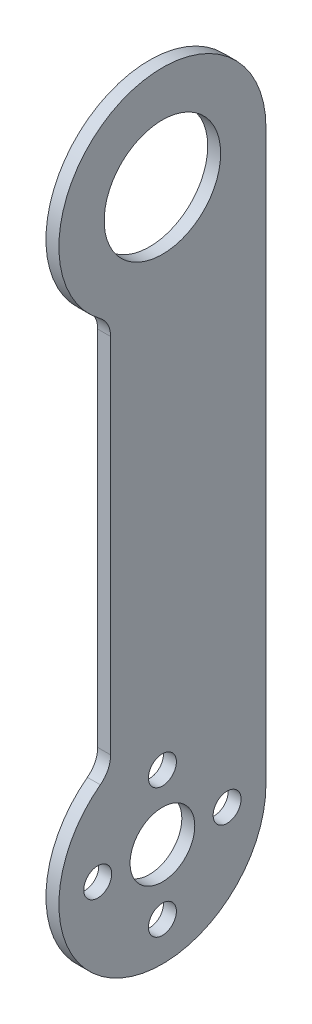
ISO-10303-21;
HEADER;
FILE_DESCRIPTION(('STEP AP214'),'2;1');
FILE_NAME('part.step','',(''),(''),'','','');
FILE_SCHEMA(('AUTOMOTIVE_DESIGN { 1 0 10303 214 1 1 1 1 }'));
ENDSEC;
DATA;
#1=APPLICATION_CONTEXT('core data for automotive mechanical design processes');
#2=APPLICATION_PROTOCOL_DEFINITION('international standard','automotive_design',2000,#1);
#3=PRODUCT_CONTEXT('',#1,'mechanical');
#4=PRODUCT('Part','Part','',(#3));
#5=PRODUCT_RELATED_PRODUCT_CATEGORY('part','',(#4));
#6=PRODUCT_DEFINITION_FORMATION('','',#4);
#7=PRODUCT_DEFINITION_CONTEXT('part definition',#1,'design');
#8=PRODUCT_DEFINITION('design','',#6,#7);
#9=PRODUCT_DEFINITION_SHAPE('','',#8);
#10=(LENGTH_UNIT() NAMED_UNIT(*) SI_UNIT(.MILLI.,.METRE.));
#11=(NAMED_UNIT(*) PLANE_ANGLE_UNIT() SI_UNIT($,.RADIAN.));
#12=(NAMED_UNIT(*) SI_UNIT($,.STERADIAN.) SOLID_ANGLE_UNIT());
#13=UNCERTAINTY_MEASURE_WITH_UNIT(LENGTH_MEASURE(1.E-05),#10,'distance_accuracy_value','');
#14=(GEOMETRIC_REPRESENTATION_CONTEXT(3) GLOBAL_UNCERTAINTY_ASSIGNED_CONTEXT((#13)) GLOBAL_UNIT_ASSIGNED_CONTEXT((#10,
#11,#12)) REPRESENTATION_CONTEXT('',''));
#15=CARTESIAN_POINT('',(0.,0.,0.));
#16=DIRECTION('',(0.,0.,1.));
#17=DIRECTION('',(1.,0.,0.));
#18=AXIS2_PLACEMENT_3D('',#15,#16,#17);
#19=CARTESIAN_POINT('',(3.175,139.7,0.));
#20=DIRECTION('',(1.,0.,0.));
#21=DIRECTION('',(0.,0.,-1.));
#22=AXIS2_PLACEMENT_3D('',#19,#20,#21);
#23=PLANE('',#22);
#24=CARTESIAN_POINT('',(3.175,-15.875,1.10854532508269E-13));
#25=DIRECTION('',(1.,0.,0.));
#26=DIRECTION('',(0.,0.,-1.));
#27=AXIS2_PLACEMENT_3D('',#24,#25,#26);
#28=CIRCLE('',#27,3.429);
#29=CARTESIAN_POINT('',(3.175,-15.875,-3.42899999999989));
#30=VERTEX_POINT('',#29);
#31=EDGE_CURVE('E224',#30,#30,#28,.T.);
#32=ORIENTED_EDGE('',*,*,#31,.F.);
#33=EDGE_LOOP('',(#32));
#34=FACE_BOUND('',#33,.T.);
#35=CARTESIAN_POINT('',(3.175,15.875,0.));
#36=DIRECTION('',(1.,0.,0.));
#37=DIRECTION('',(0.,0.,-1.));
#38=AXIS2_PLACEMENT_3D('',#35,#36,#37);
#39=CIRCLE('',#38,3.429);
#40=CARTESIAN_POINT('',(3.175,15.875,-3.429));
#41=VERTEX_POINT('',#40);
#42=EDGE_CURVE('E240',#41,#41,#39,.T.);
#43=ORIENTED_EDGE('',*,*,#42,.F.);
#44=EDGE_LOOP('',(#43));
#45=FACE_BOUND('',#44,.T.);
#46=CARTESIAN_POINT('',(3.175,0.,0.));
#47=DIRECTION('',(1.,0.,0.));
#48=DIRECTION('',(0.,0.,-1.));
#49=AXIS2_PLACEMENT_3D('',#46,#47,#48);
#50=CIRCLE('',#49,7.9375);
#51=CARTESIAN_POINT('',(3.175,0.,-7.9375));
#52=VERTEX_POINT('',#51);
#53=EDGE_CURVE('E138',#52,#52,#50,.T.);
#54=ORIENTED_EDGE('',*,*,#53,.F.);
#55=EDGE_LOOP('',(#54));
#56=FACE_BOUND('',#55,.T.);
#57=CARTESIAN_POINT('',(3.175,139.7,0.));
#58=DIRECTION('',(1.,0.,0.));
#59=DIRECTION('',(0.,0.,-1.));
#60=AXIS2_PLACEMENT_3D('',#57,#58,#59);
#61=CIRCLE('',#60,25.4);
#62=CARTESIAN_POINT('',(3.175,139.7,-25.4));
#63=VERTEX_POINT('',#62);
#64=CARTESIAN_POINT('',(3.175,119.38,15.24));
#65=VERTEX_POINT('',#64);
#66=EDGE_CURVE('E150',#63,#65,#61,.T.);
#67=ORIENTED_EDGE('',*,*,#66,.T.);
#68=CARTESIAN_POINT('',(3.175,114.3,19.05));
#69=DIRECTION('',(-1.,0.,0.));
#70=DIRECTION('',(0.,0.,-1.));
#71=AXIS2_PLACEMENT_3D('',#68,#69,#70);
#72=CIRCLE('',#71,6.35);
#73=CARTESIAN_POINT('',(3.175,114.3,12.7));
#74=VERTEX_POINT('',#73);
#75=EDGE_CURVE('E98',#65,#74,#72,.T.);
#76=ORIENTED_EDGE('',*,*,#75,.T.);
#77=DIRECTION('',(0.,-1.,0.));
#78=VECTOR('',#77,1.);
#79=CARTESIAN_POINT('',(3.175,114.3,12.7));
#80=LINE('',#79,#78);
#81=CARTESIAN_POINT('',(3.175,25.4,12.7));
#82=VERTEX_POINT('',#81);
#83=EDGE_CURVE('E111',#74,#82,#80,.T.);
#84=ORIENTED_EDGE('',*,*,#83,.T.);
#85=CARTESIAN_POINT('',(3.175,25.4,19.05));
#86=DIRECTION('',(-1.,0.,0.));
#87=DIRECTION('',(0.,0.,1.));
#88=AXIS2_PLACEMENT_3D('',#85,#86,#87);
#89=CIRCLE('',#88,6.35);
#90=CARTESIAN_POINT('',(3.175,20.32,15.24));
#91=VERTEX_POINT('',#90);
#92=EDGE_CURVE('E105',#82,#91,#89,.T.);
#93=ORIENTED_EDGE('',*,*,#92,.T.);
#94=CARTESIAN_POINT('',(3.175,0.,0.));
#95=DIRECTION('',(1.,0.,0.));
#96=DIRECTION('',(0.,0.,-1.));
#97=AXIS2_PLACEMENT_3D('',#94,#95,#96);
#98=CIRCLE('',#97,25.4);
#99=CARTESIAN_POINT('',(3.175,0.,-25.4));
#100=VERTEX_POINT('',#99);
#101=EDGE_CURVE('E109',#91,#100,#98,.T.);
#102=ORIENTED_EDGE('',*,*,#101,.T.);
#103=DIRECTION('',(0.,1.,0.));
#104=VECTOR('',#103,1.);
#105=CARTESIAN_POINT('',(3.175,139.7,-25.4));
#106=LINE('',#105,#104);
#107=EDGE_CURVE('E61',#100,#63,#106,.T.);
#108=ORIENTED_EDGE('',*,*,#107,.T.);
#109=EDGE_LOOP('',(#67,#76,#84,#93,#102,#108));
#110=FACE_BOUND('',#109,.T.);
#111=CARTESIAN_POINT('',(3.175,139.7,0.));
#112=DIRECTION('',(1.,0.,0.));
#113=DIRECTION('',(0.,0.,-1.));
#114=AXIS2_PLACEMENT_3D('',#111,#112,#113);
#115=CIRCLE('',#114,14.2875);
#116=CARTESIAN_POINT('',(3.175,139.7,-14.2875));
#117=VERTEX_POINT('',#116);
#118=EDGE_CURVE('E248',#117,#117,#115,.T.);
#119=ORIENTED_EDGE('',*,*,#118,.F.);
#120=EDGE_LOOP('',(#119));
#121=FACE_BOUND('',#120,.T.);
#122=CARTESIAN_POINT('',(3.175,0.,-15.875));
#123=DIRECTION('',(1.,0.,0.));
#124=DIRECTION('',(0.,0.,-1.));
#125=AXIS2_PLACEMENT_3D('',#122,#123,#124);
#126=CIRCLE('',#125,3.429);
#127=CARTESIAN_POINT('',(3.175,0.,-19.304));
#128=VERTEX_POINT('',#127);
#129=EDGE_CURVE('E232',#128,#128,#126,.T.);
#130=ORIENTED_EDGE('',*,*,#129,.F.);
#131=EDGE_LOOP('',(#130));
#132=FACE_BOUND('',#131,.T.);
#133=CARTESIAN_POINT('',(3.175,0.,15.875));
#134=DIRECTION('',(1.,0.,0.));
#135=DIRECTION('',(0.,0.,-1.));
#136=AXIS2_PLACEMENT_3D('',#133,#134,#135);
#137=CIRCLE('',#136,3.42900000000016);
#138=CARTESIAN_POINT('',(3.175,0.,12.4459999999998));
#139=VERTEX_POINT('',#138);
#140=EDGE_CURVE('E213',#139,#139,#137,.T.);
#141=ORIENTED_EDGE('',*,*,#140,.F.);
#142=EDGE_LOOP('',(#141));
#143=FACE_BOUND('',#142,.T.);
#144=ADVANCED_FACE('F43',(#34,#45,#56,#110,#121,#132,#143),#23,.T.);
#145=CARTESIAN_POINT('',(0.,139.7,0.));
#146=DIRECTION('',(1.,0.,0.));
#147=DIRECTION('',(0.,0.,-1.));
#148=AXIS2_PLACEMENT_3D('',#145,#146,#147);
#149=PLANE('',#148);
#150=CARTESIAN_POINT('',(0.,139.7,0.));
#151=DIRECTION('',(1.,0.,0.));
#152=DIRECTION('',(0.,0.,-1.));
#153=AXIS2_PLACEMENT_3D('',#150,#151,#152);
#154=CIRCLE('',#153,25.4);
#155=CARTESIAN_POINT('',(0.,139.7,-25.4));
#156=VERTEX_POINT('',#155);
#157=CARTESIAN_POINT('',(0.,119.38,15.24));
#158=VERTEX_POINT('',#157);
#159=EDGE_CURVE('E133',#156,#158,#154,.T.);
#160=ORIENTED_EDGE('',*,*,#159,.F.);
#161=DIRECTION('',(0.,1.,0.));
#162=VECTOR('',#161,1.);
#163=CARTESIAN_POINT('',(0.,139.7,-25.4));
#164=LINE('',#163,#162);
#165=CARTESIAN_POINT('',(0.,0.,-25.4));
#166=VERTEX_POINT('',#165);
#167=EDGE_CURVE('E90',#166,#156,#164,.T.);
#168=ORIENTED_EDGE('',*,*,#167,.F.);
#169=CARTESIAN_POINT('',(0.,0.,0.));
#170=DIRECTION('',(1.,0.,0.));
#171=DIRECTION('',(0.,0.,-1.));
#172=AXIS2_PLACEMENT_3D('',#169,#170,#171);
#173=CIRCLE('',#172,25.4);
#174=CARTESIAN_POINT('',(0.,20.32,15.24));
#175=VERTEX_POINT('',#174);
#176=EDGE_CURVE('E84',#175,#166,#173,.T.);
#177=ORIENTED_EDGE('',*,*,#176,.F.);
#178=CARTESIAN_POINT('',(0.,25.4,19.05));
#179=DIRECTION('',(-1.,0.,0.));
#180=DIRECTION('',(0.,0.,1.));
#181=AXIS2_PLACEMENT_3D('',#178,#179,#180);
#182=CIRCLE('',#181,6.35);
#183=CARTESIAN_POINT('',(0.,25.4,12.7));
#184=VERTEX_POINT('',#183);
#185=EDGE_CURVE('E120',#184,#175,#182,.T.);
#186=ORIENTED_EDGE('',*,*,#185,.F.);
#187=DIRECTION('',(0.,-1.,0.));
#188=VECTOR('',#187,1.);
#189=CARTESIAN_POINT('',(0.,114.3,12.7));
#190=LINE('',#189,#188);
#191=CARTESIAN_POINT('',(0.,114.3,12.7));
#192=VERTEX_POINT('',#191);
#193=EDGE_CURVE('E141',#192,#184,#190,.T.);
#194=ORIENTED_EDGE('',*,*,#193,.F.);
#195=CARTESIAN_POINT('',(0.,114.3,19.05));
#196=DIRECTION('',(-1.,0.,0.));
#197=DIRECTION('',(0.,0.,-1.));
#198=AXIS2_PLACEMENT_3D('',#195,#196,#197);
#199=CIRCLE('',#198,6.35);
#200=EDGE_CURVE('E137',#158,#192,#199,.T.);
#201=ORIENTED_EDGE('',*,*,#200,.F.);
#202=EDGE_LOOP('',(#160,#168,#177,#186,#194,#201));
#203=FACE_BOUND('',#202,.T.);
#204=CARTESIAN_POINT('',(0.,0.,0.));
#205=DIRECTION('',(1.,0.,0.));
#206=DIRECTION('',(0.,0.,-1.));
#207=AXIS2_PLACEMENT_3D('',#204,#205,#206);
#208=CIRCLE('',#207,7.9375);
#209=CARTESIAN_POINT('',(0.,0.,-7.9375));
#210=VERTEX_POINT('',#209);
#211=EDGE_CURVE('E252',#210,#210,#208,.T.);
#212=ORIENTED_EDGE('',*,*,#211,.T.);
#213=EDGE_LOOP('',(#212));
#214=FACE_BOUND('',#213,.T.);
#215=CARTESIAN_POINT('',(0.,139.7,0.));
#216=DIRECTION('',(1.,0.,0.));
#217=DIRECTION('',(0.,0.,-1.));
#218=AXIS2_PLACEMENT_3D('',#215,#216,#217);
#219=CIRCLE('',#218,14.2875);
#220=CARTESIAN_POINT('',(0.,139.7,-14.2875));
#221=VERTEX_POINT('',#220);
#222=EDGE_CURVE('E244',#221,#221,#219,.T.);
#223=ORIENTED_EDGE('',*,*,#222,.T.);
#224=EDGE_LOOP('',(#223));
#225=FACE_BOUND('',#224,.T.);
#226=CARTESIAN_POINT('',(0.,15.875,0.));
#227=DIRECTION('',(1.,0.,0.));
#228=DIRECTION('',(0.,0.,-1.));
#229=AXIS2_PLACEMENT_3D('',#226,#227,#228);
#230=CIRCLE('',#229,3.429);
#231=CARTESIAN_POINT('',(0.,15.875,-3.429));
#232=VERTEX_POINT('',#231);
#233=EDGE_CURVE('E236',#232,#232,#230,.T.);
#234=ORIENTED_EDGE('',*,*,#233,.T.);
#235=EDGE_LOOP('',(#234));
#236=FACE_BOUND('',#235,.T.);
#237=CARTESIAN_POINT('',(0.,0.,-15.875));
#238=DIRECTION('',(1.,0.,0.));
#239=DIRECTION('',(0.,0.,-1.));
#240=AXIS2_PLACEMENT_3D('',#237,#238,#239);
#241=CIRCLE('',#240,3.429);
#242=CARTESIAN_POINT('',(0.,0.,-19.304));
#243=VERTEX_POINT('',#242);
#244=EDGE_CURVE('E228',#243,#243,#241,.T.);
#245=ORIENTED_EDGE('',*,*,#244,.T.);
#246=EDGE_LOOP('',(#245));
#247=FACE_BOUND('',#246,.T.);
#248=CARTESIAN_POINT('',(0.,-15.875,1.10854532508269E-13));
#249=DIRECTION('',(1.,0.,0.));
#250=DIRECTION('',(0.,0.,-1.));
#251=AXIS2_PLACEMENT_3D('',#248,#249,#250);
#252=CIRCLE('',#251,3.429);
#253=CARTESIAN_POINT('',(0.,-15.875,-3.42899999999989));
#254=VERTEX_POINT('',#253);
#255=EDGE_CURVE('E221',#254,#254,#252,.T.);
#256=ORIENTED_EDGE('',*,*,#255,.T.);
#257=EDGE_LOOP('',(#256));
#258=FACE_BOUND('',#257,.T.);
#259=CARTESIAN_POINT('',(0.,0.,15.875));
#260=DIRECTION('',(1.,0.,0.));
#261=DIRECTION('',(0.,0.,-1.));
#262=AXIS2_PLACEMENT_3D('',#259,#260,#261);
#263=CIRCLE('',#262,3.42900000000016);
#264=CARTESIAN_POINT('',(0.,0.,12.4459999999998));
#265=VERTEX_POINT('',#264);
#266=EDGE_CURVE('E216',#265,#265,#263,.T.);
#267=ORIENTED_EDGE('',*,*,#266,.T.);
#268=EDGE_LOOP('',(#267));
#269=FACE_BOUND('',#268,.T.);
#270=ADVANCED_FACE('F163',(#203,#214,#225,#236,#247,#258,#269),#149,.F.);
#271=CARTESIAN_POINT('',(3.175,139.7,0.));
#272=DIRECTION('',(-1.,0.,0.));
#273=DIRECTION('',(0.,0.,1.));
#274=AXIS2_PLACEMENT_3D('',#271,#272,#273);
#275=CYLINDRICAL_SURFACE('',#274,25.4);
#276=ORIENTED_EDGE('',*,*,#159,.T.);
#277=DIRECTION('',(-1.,0.,0.));
#278=VECTOR('',#277,1.);
#279=CARTESIAN_POINT('',(3.175,119.38,15.24));
#280=LINE('',#279,#278);
#281=EDGE_CURVE('E11',#65,#158,#280,.T.);
#282=ORIENTED_EDGE('',*,*,#281,.F.);
#283=ORIENTED_EDGE('',*,*,#66,.F.);
#284=DIRECTION('',(-1.,0.,0.));
#285=VECTOR('',#284,1.);
#286=CARTESIAN_POINT('',(3.175,139.7,-25.4));
#287=LINE('',#286,#285);
#288=EDGE_CURVE('E129',#63,#156,#287,.T.);
#289=ORIENTED_EDGE('',*,*,#288,.T.);
#290=EDGE_LOOP('',(#276,#282,#283,#289));
#291=FACE_BOUND('',#290,.T.);
#292=ADVANCED_FACE('F45',(#291),#275,.T.);
#293=CARTESIAN_POINT('',(3.175,114.3,19.05));
#294=DIRECTION('',(-1.,0.,0.));
#295=DIRECTION('',(0.,0.,1.));
#296=AXIS2_PLACEMENT_3D('',#293,#294,#295);
#297=CYLINDRICAL_SURFACE('',#296,6.35);
#298=ORIENTED_EDGE('',*,*,#200,.T.);
#299=DIRECTION('',(-1.,0.,0.));
#300=VECTOR('',#299,1.);
#301=CARTESIAN_POINT('',(3.175,114.3,12.7));
#302=LINE('',#301,#300);
#303=EDGE_CURVE('E53',#74,#192,#302,.T.);
#304=ORIENTED_EDGE('',*,*,#303,.F.);
#305=ORIENTED_EDGE('',*,*,#75,.F.);
#306=ORIENTED_EDGE('',*,*,#281,.T.);
#307=EDGE_LOOP('',(#298,#304,#305,#306));
#308=FACE_BOUND('',#307,.T.);
#309=ADVANCED_FACE('F338',(#308),#297,.F.);
#310=CARTESIAN_POINT('',(3.175,114.3,12.7));
#311=DIRECTION('',(0.,0.,-1.));
#312=DIRECTION('',(0.,1.,0.));
#313=AXIS2_PLACEMENT_3D('',#310,#311,#312);
#314=PLANE('',#313);
#315=ORIENTED_EDGE('',*,*,#193,.T.);
#316=DIRECTION('',(-1.,0.,0.));
#317=VECTOR('',#316,1.);
#318=CARTESIAN_POINT('',(3.175,25.4,12.7));
#319=LINE('',#318,#317);
#320=EDGE_CURVE('E122',#82,#184,#319,.T.);
#321=ORIENTED_EDGE('',*,*,#320,.F.);
#322=ORIENTED_EDGE('',*,*,#83,.F.);
#323=ORIENTED_EDGE('',*,*,#303,.T.);
#324=EDGE_LOOP('',(#315,#321,#322,#323));
#325=FACE_BOUND('',#324,.T.);
#326=ADVANCED_FACE('F160',(#325),#314,.F.);
#327=CARTESIAN_POINT('',(3.175,25.4,19.05));
#328=DIRECTION('',(-1.,0.,0.));
#329=DIRECTION('',(0.,0.,1.));
#330=AXIS2_PLACEMENT_3D('',#327,#328,#329);
#331=CYLINDRICAL_SURFACE('',#330,6.35);
#332=ORIENTED_EDGE('',*,*,#185,.T.);
#333=DIRECTION('',(-1.,0.,0.));
#334=VECTOR('',#333,1.);
#335=CARTESIAN_POINT('',(3.175,20.32,15.24));
#336=LINE('',#335,#334);
#337=EDGE_CURVE('E117',#91,#175,#336,.T.);
#338=ORIENTED_EDGE('',*,*,#337,.F.);
#339=ORIENTED_EDGE('',*,*,#92,.F.);
#340=ORIENTED_EDGE('',*,*,#320,.T.);
#341=EDGE_LOOP('',(#332,#338,#339,#340));
#342=FACE_BOUND('',#341,.T.);
#343=ADVANCED_FACE('F118',(#342),#331,.F.);
#344=CARTESIAN_POINT('',(3.175,0.,0.));
#345=DIRECTION('',(-1.,0.,0.));
#346=DIRECTION('',(0.,0.,1.));
#347=AXIS2_PLACEMENT_3D('',#344,#345,#346);
#348=CYLINDRICAL_SURFACE('',#347,25.4);
#349=ORIENTED_EDGE('',*,*,#176,.T.);
#350=DIRECTION('',(-1.,0.,0.));
#351=VECTOR('',#350,1.);
#352=CARTESIAN_POINT('',(3.175,0.,-25.4));
#353=LINE('',#352,#351);
#354=EDGE_CURVE('E123',#100,#166,#353,.T.);
#355=ORIENTED_EDGE('',*,*,#354,.F.);
#356=ORIENTED_EDGE('',*,*,#101,.F.);
#357=ORIENTED_EDGE('',*,*,#337,.T.);
#358=EDGE_LOOP('',(#349,#355,#356,#357));
#359=FACE_BOUND('',#358,.T.);
#360=ADVANCED_FACE('F125',(#359),#348,.T.);
#361=CARTESIAN_POINT('',(3.175,139.7,-25.4));
#362=DIRECTION('',(0.,0.,1.));
#363=DIRECTION('',(0.,-1.,0.));
#364=AXIS2_PLACEMENT_3D('',#361,#362,#363);
#365=PLANE('',#364);
#366=ORIENTED_EDGE('',*,*,#167,.T.);
#367=ORIENTED_EDGE('',*,*,#288,.F.);
#368=ORIENTED_EDGE('',*,*,#107,.F.);
#369=ORIENTED_EDGE('',*,*,#354,.T.);
#370=EDGE_LOOP('',(#366,#367,#368,#369));
#371=FACE_BOUND('',#370,.T.);
#372=ADVANCED_FACE('F168',(#371),#365,.F.);
#373=CARTESIAN_POINT('',(3.175,0.,0.));
#374=DIRECTION('',(-1.,0.,0.));
#375=DIRECTION('',(0.,0.,1.));
#376=AXIS2_PLACEMENT_3D('',#373,#374,#375);
#377=CYLINDRICAL_SURFACE('',#376,7.9375);
#378=ORIENTED_EDGE('',*,*,#53,.T.);
#379=EDGE_LOOP('',(#378));
#380=FACE_BOUND('',#379,.T.);
#381=ORIENTED_EDGE('',*,*,#211,.F.);
#382=EDGE_LOOP('',(#381));
#383=FACE_BOUND('',#382,.T.);
#384=ADVANCED_FACE('F170',(#380,#383),#377,.F.);
#385=CARTESIAN_POINT('',(3.175,139.7,0.));
#386=DIRECTION('',(-1.,0.,0.));
#387=DIRECTION('',(0.,0.,1.));
#388=AXIS2_PLACEMENT_3D('',#385,#386,#387);
#389=CYLINDRICAL_SURFACE('',#388,14.2875);
#390=ORIENTED_EDGE('',*,*,#118,.T.);
#391=EDGE_LOOP('',(#390));
#392=FACE_BOUND('',#391,.T.);
#393=ORIENTED_EDGE('',*,*,#222,.F.);
#394=EDGE_LOOP('',(#393));
#395=FACE_BOUND('',#394,.T.);
#396=ADVANCED_FACE('F176',(#392,#395),#389,.F.);
#397=CARTESIAN_POINT('',(3.175,15.875,0.));
#398=DIRECTION('',(-1.,0.,0.));
#399=DIRECTION('',(0.,0.,1.));
#400=AXIS2_PLACEMENT_3D('',#397,#398,#399);
#401=CYLINDRICAL_SURFACE('',#400,3.429);
#402=ORIENTED_EDGE('',*,*,#42,.T.);
#403=EDGE_LOOP('',(#402));
#404=FACE_BOUND('',#403,.T.);
#405=ORIENTED_EDGE('',*,*,#233,.F.);
#406=EDGE_LOOP('',(#405));
#407=FACE_BOUND('',#406,.T.);
#408=ADVANCED_FACE('F192',(#404,#407),#401,.F.);
#409=CARTESIAN_POINT('',(3.175,0.,-15.875));
#410=DIRECTION('',(-1.,0.,0.));
#411=DIRECTION('',(0.,0.,1.));
#412=AXIS2_PLACEMENT_3D('',#409,#410,#411);
#413=CYLINDRICAL_SURFACE('',#412,3.429);
#414=ORIENTED_EDGE('',*,*,#129,.T.);
#415=EDGE_LOOP('',(#414));
#416=FACE_BOUND('',#415,.T.);
#417=ORIENTED_EDGE('',*,*,#244,.F.);
#418=EDGE_LOOP('',(#417));
#419=FACE_BOUND('',#418,.T.);
#420=ADVANCED_FACE('F196',(#416,#419),#413,.F.);
#421=CARTESIAN_POINT('',(3.175,-15.875,1.10854532508269E-13));
#422=DIRECTION('',(-1.,0.,0.));
#423=DIRECTION('',(0.,0.,1.));
#424=AXIS2_PLACEMENT_3D('',#421,#422,#423);
#425=CYLINDRICAL_SURFACE('',#424,3.429);
#426=ORIENTED_EDGE('',*,*,#31,.T.);
#427=EDGE_LOOP('',(#426));
#428=FACE_BOUND('',#427,.T.);
#429=ORIENTED_EDGE('',*,*,#255,.F.);
#430=EDGE_LOOP('',(#429));
#431=FACE_BOUND('',#430,.T.);
#432=ADVANCED_FACE('F200',(#428,#431),#425,.F.);
#433=CARTESIAN_POINT('',(3.175,0.,15.875));
#434=DIRECTION('',(-1.,0.,0.));
#435=DIRECTION('',(0.,0.,1.));
#436=AXIS2_PLACEMENT_3D('',#433,#434,#435);
#437=CYLINDRICAL_SURFACE('',#436,3.42900000000016);
#438=ORIENTED_EDGE('',*,*,#140,.T.);
#439=EDGE_LOOP('',(#438));
#440=FACE_BOUND('',#439,.T.);
#441=ORIENTED_EDGE('',*,*,#266,.F.);
#442=EDGE_LOOP('',(#441));
#443=FACE_BOUND('',#442,.T.);
#444=ADVANCED_FACE('F204',(#440,#443),#437,.F.);
#445=CLOSED_SHELL('',(#144,#270,#292,#309,#326,#343,#360,#372,#384,#396,#408,#420,#432,#444));
#446=MANIFOLD_SOLID_BREP('B2',#445);
#447=ADVANCED_BREP_SHAPE_REPRESENTATION('',(#18,#446),#14);
#448=SHAPE_DEFINITION_REPRESENTATION(#9,#447);
ENDSEC;
END-ISO-10303-21;
